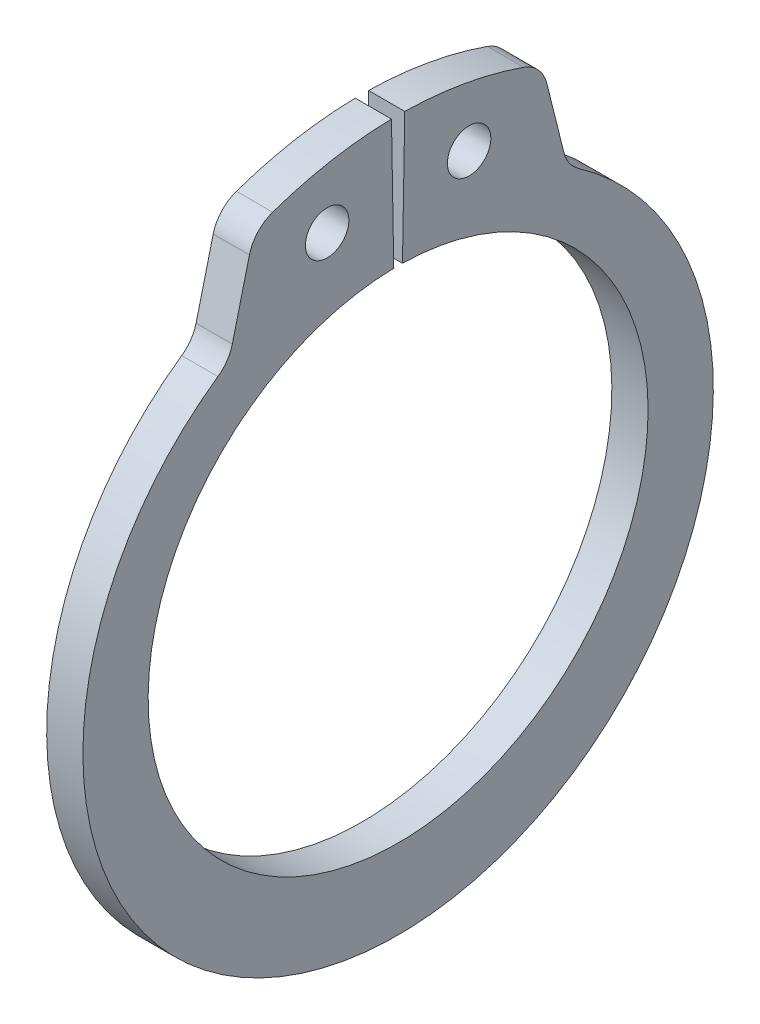
ISO-10303-21;
HEADER;
FILE_DESCRIPTION(('STEP AP214'),'2;1');
FILE_NAME('part.step','',(''),(''),'','','');
FILE_SCHEMA(('AUTOMOTIVE_DESIGN { 1 0 10303 214 1 1 1 1 }'));
ENDSEC;
DATA;
#1=APPLICATION_CONTEXT('core data for automotive mechanical design processes');
#2=APPLICATION_PROTOCOL_DEFINITION('international standard','automotive_design',2000,#1);
#3=PRODUCT_CONTEXT('',#1,'mechanical');
#4=PRODUCT('Part','Part','',(#3));
#5=PRODUCT_RELATED_PRODUCT_CATEGORY('part','',(#4));
#6=PRODUCT_DEFINITION_FORMATION('','',#4);
#7=PRODUCT_DEFINITION_CONTEXT('part definition',#1,'design');
#8=PRODUCT_DEFINITION('design','',#6,#7);
#9=PRODUCT_DEFINITION_SHAPE('','',#8);
#10=(LENGTH_UNIT() NAMED_UNIT(*) SI_UNIT(.MILLI.,.METRE.));
#11=(NAMED_UNIT(*) PLANE_ANGLE_UNIT() SI_UNIT($,.RADIAN.));
#12=(NAMED_UNIT(*) SI_UNIT($,.STERADIAN.) SOLID_ANGLE_UNIT());
#13=UNCERTAINTY_MEASURE_WITH_UNIT(LENGTH_MEASURE(1.E-05),#10,'distance_accuracy_value','');
#14=(GEOMETRIC_REPRESENTATION_CONTEXT(3) GLOBAL_UNCERTAINTY_ASSIGNED_CONTEXT((#13)) GLOBAL_UNIT_ASSIGNED_CONTEXT((#10,
#11,#12)) REPRESENTATION_CONTEXT('',''));
#15=CARTESIAN_POINT('',(0.,0.,0.));
#16=DIRECTION('',(0.,0.,1.));
#17=DIRECTION('',(1.,0.,0.));
#18=AXIS2_PLACEMENT_3D('',#15,#16,#17);
#19=CARTESIAN_POINT('',(-0.500000000000167,0.,0.));
#20=DIRECTION('',(0.999999999999999,0.,0.));
#21=DIRECTION('',(0.,0.,-1.));
#22=AXIS2_PLACEMENT_3D('',#19,#20,#21);
#23=PLANE('',#22);
#24=CARTESIAN_POINT('',(-0.500000000000167,8.66711980548374,-1.95962883161993));
#25=DIRECTION('',(-0.999999999999999,0.,0.));
#26=DIRECTION('',(0.,0.,1.));
#27=AXIS2_PLACEMENT_3D('',#24,#25,#26);
#28=CIRCLE('',#27,0.6);
#29=CARTESIAN_POINT('',(-0.500000000000167,8.66711980548374,-1.35962883161993));
#30=VERTEX_POINT('',#29);
#31=EDGE_CURVE('E125',#30,#30,#28,.F.);
#32=ORIENTED_EDGE('',*,*,#31,.T.);
#33=EDGE_LOOP('',(#32));
#34=FACE_BOUND('',#33,.T.);
#35=CARTESIAN_POINT('',(-0.500000000000167,8.96816184311078,3.13401869099739));
#36=DIRECTION('',(-0.999999999999999,0.,0.));
#37=DIRECTION('',(0.,0.,1.));
#38=AXIS2_PLACEMENT_3D('',#35,#36,#37);
#39=CIRCLE('',#38,1.);
#40=CARTESIAN_POINT('',(-0.500000000000167,9.9121788792349,3.46391539531066));
#41=VERTEX_POINT('',#40);
#42=CARTESIAN_POINT('',(-0.500000000000167,9.2100837387239,4.10431441727255));
#43=VERTEX_POINT('',#42);
#44=EDGE_CURVE('E111',#41,#43,#39,.F.);
#45=ORIENTED_EDGE('',*,*,#44,.F.);
#46=CARTESIAN_POINT('',(-0.500000000000167,0.,0.));
#47=DIRECTION('',(-0.999999999999999,0.,0.));
#48=DIRECTION('',(0.,0.,1.));
#49=AXIS2_PLACEMENT_3D('',#46,#47,#48);
#50=CIRCLE('',#49,10.5);
#51=CARTESIAN_POINT('',(-0.500000000000167,10.4984007991398,0.183250267589585));
#52=VERTEX_POINT('',#51);
#53=EDGE_CURVE('E104',#52,#41,#50,.F.);
#54=ORIENTED_EDGE('',*,*,#53,.F.);
#55=DIRECTION('',(0.,-0.999847695156392,-0.0174524064372835));
#56=VECTOR('',#55,1.);
#57=CARTESIAN_POINT('',(-0.500000000000167,6.8989490965663,0.120421604415721));
#58=LINE('',#57,#56);
#59=CARTESIAN_POINT('',(-0.500000000000167,6.8989490965663,0.120421604415721));
#60=VERTEX_POINT('',#59);
#61=EDGE_CURVE('E108',#52,#60,#58,.T.);
#62=ORIENTED_EDGE('',*,*,#61,.T.);
#63=CARTESIAN_POINT('',(-0.500000000000167,0.,0.));
#64=DIRECTION('',(-0.999999999999999,0.,0.));
#65=DIRECTION('',(0.,0.,1.));
#66=AXIS2_PLACEMENT_3D('',#63,#64,#65);
#67=CIRCLE('',#66,6.9);
#68=CARTESIAN_POINT('',(-0.500000000000167,6.89894909657696,-0.120421604417054));
#69=VERTEX_POINT('',#68);
#70=EDGE_CURVE('E171',#60,#69,#67,.F.);
#71=ORIENTED_EDGE('',*,*,#70,.T.);
#72=DIRECTION('',(0.,0.999847695156392,-0.0174524064372841));
#73=VECTOR('',#72,1.);
#74=CARTESIAN_POINT('',(-0.500000000000167,10.4984007991273,-0.183250267591362));
#75=LINE('',#74,#73);
#76=CARTESIAN_POINT('',(-0.500000000000167,10.4984007991273,-0.183250267591362));
#77=VERTEX_POINT('',#76);
#78=EDGE_CURVE('E133',#69,#77,#75,.T.);
#79=ORIENTED_EDGE('',*,*,#78,.T.);
#80=CARTESIAN_POINT('',(-0.500000000000167,0.,0.));
#81=DIRECTION('',(-0.999999999999999,0.,0.));
#82=DIRECTION('',(0.,0.,1.));
#83=AXIS2_PLACEMENT_3D('',#80,#81,#82);
#84=CIRCLE('',#83,10.5);
#85=CARTESIAN_POINT('',(-0.500000000000167,9.9121788792349,-3.46391539531199));
#86=VERTEX_POINT('',#85);
#87=EDGE_CURVE('E173',#86,#77,#84,.F.);
#88=ORIENTED_EDGE('',*,*,#87,.F.);
#89=CARTESIAN_POINT('',(-0.500000000000167,8.96816184311078,-3.1340186909965));
#90=DIRECTION('',(-0.999999999999999,0.,0.));
#91=DIRECTION('',(0.,0.,1.));
#92=AXIS2_PLACEMENT_3D('',#89,#90,#91);
#93=CIRCLE('',#92,1.);
#94=CARTESIAN_POINT('',(-0.500000000000167,9.21008373871679,-4.10431441727344));
#95=VERTEX_POINT('',#94);
#96=EDGE_CURVE('E176',#95,#86,#93,.F.);
#97=ORIENTED_EDGE('',*,*,#96,.F.);
#98=DIRECTION('',(0.,-0.970295726275998,-0.241921895599666));
#99=VECTOR('',#98,1.);
#100=CARTESIAN_POINT('',(-0.500000000000167,9.71734472744501,-3.97784004803237));
#101=LINE('',#100,#99);
#102=CARTESIAN_POINT('',(-0.500000000000167,7.3176153092458,-4.57615979124038));
#103=VERTEX_POINT('',#102);
#104=EDGE_CURVE('E138',#95,#103,#101,.T.);
#105=ORIENTED_EDGE('',*,*,#104,.T.);
#106=CARTESIAN_POINT('',(-0.500000000000167,7.55953720483937,-5.54645551751332));
#107=DIRECTION('',(-0.999999999999999,0.,0.));
#108=DIRECTION('',(0.,0.,1.));
#109=AXIS2_PLACEMENT_3D('',#106,#107,#108);
#110=CIRCLE('',#109,1.);
#111=CARTESIAN_POINT('',(-0.500000000000167,6.73911195962873,-4.97470170945258));
#112=VERTEX_POINT('',#111);
#113=EDGE_CURVE('E178',#103,#112,#110,.F.);
#114=ORIENTED_EDGE('',*,*,#113,.T.);
#115=CARTESIAN_POINT('',(-0.500000000000167,-0.399224177783708,-4.44089209850063E-13));
#116=DIRECTION('',(-0.999999999999999,0.,0.));
#117=DIRECTION('',(0.,0.,1.));
#118=AXIS2_PLACEMENT_3D('',#115,#116,#117);
#119=CIRCLE('',#118,8.70077582223046);
#120=CARTESIAN_POINT('',(-0.500000000000167,6.73911195963406,4.9747017094508));
#121=VERTEX_POINT('',#120);
#122=EDGE_CURVE('E181',#121,#112,#119,.F.);
#123=ORIENTED_EDGE('',*,*,#122,.F.);
#124=CARTESIAN_POINT('',(-0.500000000000167,7.55953720483227,5.54645551751332));
#125=DIRECTION('',(-0.999999999999999,0.,0.));
#126=DIRECTION('',(0.,0.,1.));
#127=AXIS2_PLACEMENT_3D('',#124,#125,#126);
#128=CIRCLE('',#127,1.);
#129=CARTESIAN_POINT('',(-0.500000000000167,7.3176153092458,4.57615979123815));
#130=VERTEX_POINT('',#129);
#131=EDGE_CURVE('E144',#121,#130,#128,.F.);
#132=ORIENTED_EDGE('',*,*,#131,.T.);
#133=DIRECTION('',(0.,0.970295726275998,-0.241921895599665));
#134=VECTOR('',#133,1.);
#135=CARTESIAN_POINT('',(-0.500000000000167,9.71734472744501,3.97784004803192));
#136=LINE('',#135,#134);
#137=EDGE_CURVE('E143',#130,#43,#136,.T.);
#138=ORIENTED_EDGE('',*,*,#137,.T.);
#139=EDGE_LOOP('',(#45,#54,#62,#71,#79,#88,#97,#105,#114,#123,#132,#138));
#140=FACE_BOUND('',#139,.T.);
#141=CARTESIAN_POINT('',(-0.500000000000167,8.66711980547663,1.95962883161993));
#142=DIRECTION('',(-0.999999999999999,0.,0.));
#143=DIRECTION('',(0.,0.,1.));
#144=AXIS2_PLACEMENT_3D('',#141,#142,#143);
#145=CIRCLE('',#144,0.6);
#146=CARTESIAN_POINT('',(-0.500000000000167,8.66711980547663,2.55962883161993));
#147=VERTEX_POINT('',#146);
#148=EDGE_CURVE('E19',#147,#147,#145,.F.);
#149=ORIENTED_EDGE('',*,*,#148,.T.);
#150=EDGE_LOOP('',(#149));
#151=FACE_BOUND('',#150,.T.);
#152=ADVANCED_FACE('F16',(#34,#140,#151),#23,.F.);
#153=CARTESIAN_POINT('',(0.500000000000167,8.66711980547663,1.95962883161993));
#154=DIRECTION('',(-0.999999999999999,0.,0.));
#155=DIRECTION('',(0.,0.,1.));
#156=AXIS2_PLACEMENT_3D('',#153,#154,#155);
#157=CYLINDRICAL_SURFACE('',#156,0.6);
#158=CARTESIAN_POINT('',(0.500000000000167,8.66711980547663,1.95962883161993));
#159=DIRECTION('',(-0.999999999999999,0.,0.));
#160=DIRECTION('',(0.,0.,1.));
#161=AXIS2_PLACEMENT_3D('',#158,#159,#160);
#162=CIRCLE('',#161,0.6);
#163=CARTESIAN_POINT('',(0.500000000000167,8.66711980547663,2.55962883161993));
#164=VERTEX_POINT('',#163);
#165=EDGE_CURVE('E128',#164,#164,#162,.T.);
#166=ORIENTED_EDGE('',*,*,#165,.F.);
#167=EDGE_LOOP('',(#166));
#168=FACE_BOUND('',#167,.T.);
#169=ORIENTED_EDGE('',*,*,#148,.F.);
#170=EDGE_LOOP('',(#169));
#171=FACE_BOUND('',#170,.T.);
#172=ADVANCED_FACE('F271',(#168,#171),#157,.F.);
#173=CARTESIAN_POINT('',(0.500000000000167,0.,0.));
#174=DIRECTION('',(-0.999999999999999,0.,0.));
#175=DIRECTION('',(0.,0.,1.));
#176=AXIS2_PLACEMENT_3D('',#173,#174,#175);
#177=CYLINDRICAL_SURFACE('',#176,10.5);
#178=CARTESIAN_POINT('',(0.500000000000167,0.,0.));
#179=DIRECTION('',(-0.999999999999999,0.,0.));
#180=DIRECTION('',(0.,0.,1.));
#181=AXIS2_PLACEMENT_3D('',#178,#179,#180);
#182=CIRCLE('',#181,10.5);
#183=CARTESIAN_POINT('',(0.500000000000167,10.4984007991398,0.183250267589585));
#184=VERTEX_POINT('',#183);
#185=CARTESIAN_POINT('',(0.500000000000167,9.9121788792349,3.46391539531066));
#186=VERTEX_POINT('',#185);
#187=EDGE_CURVE('E119',#184,#186,#182,.F.);
#188=ORIENTED_EDGE('',*,*,#187,.F.);
#189=DIRECTION('',(0.999999999999999,0.,0.));
#190=VECTOR('',#189,1.);
#191=CARTESIAN_POINT('',(0.500000000000167,10.4984007991398,0.183250267589585));
#192=LINE('',#191,#190);
#193=EDGE_CURVE('E116',#184,#52,#192,.F.);
#194=ORIENTED_EDGE('',*,*,#193,.T.);
#195=ORIENTED_EDGE('',*,*,#53,.T.);
#196=DIRECTION('',(-0.999999999999999,0.,0.));
#197=VECTOR('',#196,1.);
#198=CARTESIAN_POINT('',(0.500000000000167,9.9121788792349,3.46391539531066));
#199=LINE('',#198,#197);
#200=EDGE_CURVE('E114',#186,#41,#199,.T.);
#201=ORIENTED_EDGE('',*,*,#200,.F.);
#202=EDGE_LOOP('',(#188,#194,#195,#201));
#203=FACE_BOUND('',#202,.T.);
#204=ADVANCED_FACE('F117',(#203),#177,.T.);
#205=CARTESIAN_POINT('',(0.500000000000167,8.96816184311078,3.13401869099739));
#206=DIRECTION('',(-0.999999999999999,0.,0.));
#207=DIRECTION('',(0.,0.,1.));
#208=AXIS2_PLACEMENT_3D('',#205,#206,#207);
#209=CYLINDRICAL_SURFACE('',#208,1.);
#210=ORIENTED_EDGE('',*,*,#44,.T.);
#211=DIRECTION('',(0.999999999999999,0.,0.));
#212=VECTOR('',#211,1.);
#213=CARTESIAN_POINT('',(0.500000000000167,9.2100837387239,4.10431441727255));
#214=LINE('',#213,#212);
#215=CARTESIAN_POINT('',(0.500000000000167,9.2100837387239,4.10431441727255));
#216=VERTEX_POINT('',#215);
#217=EDGE_CURVE('E145',#43,#216,#214,.T.);
#218=ORIENTED_EDGE('',*,*,#217,.T.);
#219=CARTESIAN_POINT('',(0.500000000000167,8.96816184311078,3.13401869099739));
#220=DIRECTION('',(-0.999999999999999,0.,0.));
#221=DIRECTION('',(0.,0.,1.));
#222=AXIS2_PLACEMENT_3D('',#219,#220,#221);
#223=CIRCLE('',#222,1.);
#224=EDGE_CURVE('E165',#186,#216,#223,.F.);
#225=ORIENTED_EDGE('',*,*,#224,.F.);
#226=ORIENTED_EDGE('',*,*,#200,.T.);
#227=EDGE_LOOP('',(#210,#218,#225,#226));
#228=FACE_BOUND('',#227,.T.);
#229=ADVANCED_FACE('F189',(#228),#209,.T.);
#230=CARTESIAN_POINT('',(0.500000000000167,9.71734472744501,3.97784004803192));
#231=DIRECTION('',(0.,-0.241921895599665,-0.970295726275998));
#232=DIRECTION('',(0.,0.970295726275998,-0.241921895599665));
#233=AXIS2_PLACEMENT_3D('',#230,#231,#232);
#234=PLANE('',#233);
#235=DIRECTION('',(-0.999999999999999,0.,0.));
#236=VECTOR('',#235,1.);
#237=CARTESIAN_POINT('',(0.500000000000167,7.3176153092458,4.57615979123815));
#238=LINE('',#237,#236);
#239=CARTESIAN_POINT('',(0.500000000000167,7.3176153092458,4.57615979123815));
#240=VERTEX_POINT('',#239);
#241=EDGE_CURVE('E186',#130,#240,#238,.F.);
#242=ORIENTED_EDGE('',*,*,#241,.T.);
#243=DIRECTION('',(0.,-0.970295726275998,0.241921895599665));
#244=VECTOR('',#243,1.);
#245=CARTESIAN_POINT('',(0.500000000000167,9.2100837387239,4.10431441727255));
#246=LINE('',#245,#244);
#247=EDGE_CURVE('E164',#216,#240,#246,.T.);
#248=ORIENTED_EDGE('',*,*,#247,.F.);
#249=ORIENTED_EDGE('',*,*,#217,.F.);
#250=ORIENTED_EDGE('',*,*,#137,.F.);
#251=EDGE_LOOP('',(#242,#248,#249,#250));
#252=FACE_BOUND('',#251,.T.);
#253=ADVANCED_FACE('F217',(#252),#234,.F.);
#254=CARTESIAN_POINT('',(0.500000000000167,7.55953720483227,5.54645551751332));
#255=DIRECTION('',(-0.999999999999999,0.,0.));
#256=DIRECTION('',(0.,0.,1.));
#257=AXIS2_PLACEMENT_3D('',#254,#255,#256);
#258=CYLINDRICAL_SURFACE('',#257,1.);
#259=ORIENTED_EDGE('',*,*,#241,.F.);
#260=ORIENTED_EDGE('',*,*,#131,.F.);
#261=DIRECTION('',(-0.999999999999999,0.,0.));
#262=VECTOR('',#261,1.);
#263=CARTESIAN_POINT('',(0.500000000000167,6.73911195963406,4.9747017094508));
#264=LINE('',#263,#262);
#265=CARTESIAN_POINT('',(0.500000000000167,6.73911195963406,4.9747017094508));
#266=VERTEX_POINT('',#265);
#267=EDGE_CURVE('E184',#266,#121,#264,.T.);
#268=ORIENTED_EDGE('',*,*,#267,.F.);
#269=CARTESIAN_POINT('',(0.500000000000167,7.55953720483227,5.54645551751332));
#270=DIRECTION('',(-0.999999999999999,0.,0.));
#271=DIRECTION('',(0.,0.,1.));
#272=AXIS2_PLACEMENT_3D('',#269,#270,#271);
#273=CIRCLE('',#272,1.);
#274=EDGE_CURVE('E161',#240,#266,#273,.T.);
#275=ORIENTED_EDGE('',*,*,#274,.F.);
#276=EDGE_LOOP('',(#259,#260,#268,#275));
#277=FACE_BOUND('',#276,.T.);
#278=ADVANCED_FACE('F220',(#277),#258,.F.);
#279=CARTESIAN_POINT('',(0.500000000000167,-0.399224177783708,-4.44089209850063E-13));
#280=DIRECTION('',(-0.999999999999999,0.,0.));
#281=DIRECTION('',(0.,0.,1.));
#282=AXIS2_PLACEMENT_3D('',#279,#280,#281);
#283=CYLINDRICAL_SURFACE('',#282,8.70077582223046);
#284=ORIENTED_EDGE('',*,*,#122,.T.);
#285=DIRECTION('',(-0.999999999999999,0.,0.));
#286=VECTOR('',#285,1.);
#287=CARTESIAN_POINT('',(0.500000000000167,6.73911195962873,-4.97470170945258));
#288=LINE('',#287,#286);
#289=CARTESIAN_POINT('',(0.500000000000167,6.73911195962873,-4.97470170945258));
#290=VERTEX_POINT('',#289);
#291=EDGE_CURVE('E180',#112,#290,#288,.F.);
#292=ORIENTED_EDGE('',*,*,#291,.T.);
#293=CARTESIAN_POINT('',(0.500000000000167,-0.399224177783708,-4.44089209850063E-13));
#294=DIRECTION('',(-0.999999999999999,0.,0.));
#295=DIRECTION('',(0.,0.,1.));
#296=AXIS2_PLACEMENT_3D('',#293,#294,#295);
#297=CIRCLE('',#296,8.70077582223046);
#298=EDGE_CURVE('E159',#266,#290,#297,.F.);
#299=ORIENTED_EDGE('',*,*,#298,.F.);
#300=ORIENTED_EDGE('',*,*,#267,.T.);
#301=EDGE_LOOP('',(#284,#292,#299,#300));
#302=FACE_BOUND('',#301,.T.);
#303=ADVANCED_FACE('F225',(#302),#283,.T.);
#304=CARTESIAN_POINT('',(0.500000000000167,7.55953720483937,-5.54645551751332));
#305=DIRECTION('',(-0.999999999999999,0.,0.));
#306=DIRECTION('',(0.,0.,1.));
#307=AXIS2_PLACEMENT_3D('',#304,#305,#306);
#308=CYLINDRICAL_SURFACE('',#307,1.);
#309=ORIENTED_EDGE('',*,*,#291,.F.);
#310=ORIENTED_EDGE('',*,*,#113,.F.);
#311=DIRECTION('',(0.999999999999999,0.,0.));
#312=VECTOR('',#311,1.);
#313=CARTESIAN_POINT('',(0.500000000000167,7.3176153092458,-4.57615979124038));
#314=LINE('',#313,#312);
#315=CARTESIAN_POINT('',(0.500000000000167,7.3176153092458,-4.57615979124038));
#316=VERTEX_POINT('',#315);
#317=EDGE_CURVE('E142',#103,#316,#314,.T.);
#318=ORIENTED_EDGE('',*,*,#317,.T.);
#319=CARTESIAN_POINT('',(0.500000000000167,7.55953720483937,-5.54645551751332));
#320=DIRECTION('',(-0.999999999999999,0.,0.));
#321=DIRECTION('',(0.,0.,1.));
#322=AXIS2_PLACEMENT_3D('',#319,#320,#321);
#323=CIRCLE('',#322,1.);
#324=EDGE_CURVE('E156',#290,#316,#323,.T.);
#325=ORIENTED_EDGE('',*,*,#324,.F.);
#326=EDGE_LOOP('',(#309,#310,#318,#325));
#327=FACE_BOUND('',#326,.T.);
#328=ADVANCED_FACE('F227',(#327),#308,.F.);
#329=CARTESIAN_POINT('',(0.500000000000167,9.71734472744501,-3.97784004803237));
#330=DIRECTION('',(0.,-0.241921895599666,0.970295726275998));
#331=DIRECTION('',(0.,-0.970295726275998,-0.241921895599666));
#332=AXIS2_PLACEMENT_3D('',#329,#330,#331);
#333=PLANE('',#332);
#334=DIRECTION('',(-0.999999999999999,0.,0.));
#335=VECTOR('',#334,1.);
#336=CARTESIAN_POINT('',(0.500000000000167,9.21008373871679,-4.10431441727344));
#337=LINE('',#336,#335);
#338=CARTESIAN_POINT('',(0.500000000000167,9.21008373871679,-4.10431441727344));
#339=VERTEX_POINT('',#338);
#340=EDGE_CURVE('E141',#339,#95,#337,.T.);
#341=ORIENTED_EDGE('',*,*,#340,.F.);
#342=DIRECTION('',(0.,0.970295726275998,0.241921895599666));
#343=VECTOR('',#342,1.);
#344=CARTESIAN_POINT('',(0.500000000000167,7.3176153092458,-4.57615979124038));
#345=LINE('',#344,#343);
#346=EDGE_CURVE('E155',#316,#339,#345,.T.);
#347=ORIENTED_EDGE('',*,*,#346,.F.);
#348=ORIENTED_EDGE('',*,*,#317,.F.);
#349=ORIENTED_EDGE('',*,*,#104,.F.);
#350=EDGE_LOOP('',(#341,#347,#348,#349));
#351=FACE_BOUND('',#350,.T.);
#352=ADVANCED_FACE('F231',(#351),#333,.F.);
#353=CARTESIAN_POINT('',(0.500000000000167,8.96816184311078,-3.1340186909965));
#354=DIRECTION('',(-0.999999999999999,0.,0.));
#355=DIRECTION('',(0.,0.,1.));
#356=AXIS2_PLACEMENT_3D('',#353,#354,#355);
#357=CYLINDRICAL_SURFACE('',#356,1.);
#358=ORIENTED_EDGE('',*,*,#96,.T.);
#359=DIRECTION('',(-0.999999999999999,0.,0.));
#360=VECTOR('',#359,1.);
#361=CARTESIAN_POINT('',(0.500000000000167,9.9121788792349,-3.46391539531199));
#362=LINE('',#361,#360);
#363=CARTESIAN_POINT('',(0.500000000000167,9.9121788792349,-3.46391539531199));
#364=VERTEX_POINT('',#363);
#365=EDGE_CURVE('E175',#364,#86,#362,.T.);
#366=ORIENTED_EDGE('',*,*,#365,.F.);
#367=CARTESIAN_POINT('',(0.500000000000167,8.96816184311078,-3.1340186909965));
#368=DIRECTION('',(-0.999999999999999,0.,0.));
#369=DIRECTION('',(0.,0.,1.));
#370=AXIS2_PLACEMENT_3D('',#367,#368,#369);
#371=CIRCLE('',#370,1.);
#372=EDGE_CURVE('E152',#339,#364,#371,.F.);
#373=ORIENTED_EDGE('',*,*,#372,.F.);
#374=ORIENTED_EDGE('',*,*,#340,.T.);
#375=EDGE_LOOP('',(#358,#366,#373,#374));
#376=FACE_BOUND('',#375,.T.);
#377=ADVANCED_FACE('F235',(#376),#357,.T.);
#378=CARTESIAN_POINT('',(0.500000000000167,0.,0.));
#379=DIRECTION('',(-0.999999999999999,0.,0.));
#380=DIRECTION('',(0.,0.,1.));
#381=AXIS2_PLACEMENT_3D('',#378,#379,#380);
#382=CYLINDRICAL_SURFACE('',#381,10.5);
#383=ORIENTED_EDGE('',*,*,#87,.T.);
#384=DIRECTION('',(0.999999999999999,0.,0.));
#385=VECTOR('',#384,1.);
#386=CARTESIAN_POINT('',(0.500000000000167,10.4984007991273,-0.183250267591362));
#387=LINE('',#386,#385);
#388=CARTESIAN_POINT('',(0.500000000000167,10.4984007991273,-0.183250267591362));
#389=VERTEX_POINT('',#388);
#390=EDGE_CURVE('E137',#77,#389,#387,.T.);
#391=ORIENTED_EDGE('',*,*,#390,.T.);
#392=CARTESIAN_POINT('',(0.500000000000167,0.,0.));
#393=DIRECTION('',(-0.999999999999999,0.,0.));
#394=DIRECTION('',(0.,0.,1.));
#395=AXIS2_PLACEMENT_3D('',#392,#393,#394);
#396=CIRCLE('',#395,10.5);
#397=EDGE_CURVE('E149',#364,#389,#396,.F.);
#398=ORIENTED_EDGE('',*,*,#397,.F.);
#399=ORIENTED_EDGE('',*,*,#365,.T.);
#400=EDGE_LOOP('',(#383,#391,#398,#399));
#401=FACE_BOUND('',#400,.T.);
#402=ADVANCED_FACE('F239',(#401),#382,.T.);
#403=CARTESIAN_POINT('',(0.500000000000167,10.4984007991273,-0.183250267591362));
#404=DIRECTION('',(0.,-0.0174524064372841,-0.999847695156392));
#405=DIRECTION('',(0.,0.999847695156392,-0.0174524064372841));
#406=AXIS2_PLACEMENT_3D('',#403,#404,#405);
#407=PLANE('',#406);
#408=DIRECTION('',(-0.999999999999999,0.,0.));
#409=VECTOR('',#408,1.);
#410=CARTESIAN_POINT('',(0.500000000000167,6.89894909657696,-0.120421604417054));
#411=LINE('',#410,#409);
#412=CARTESIAN_POINT('',(0.500000000000167,6.89894909657696,-0.120421604417054));
#413=VERTEX_POINT('',#412);
#414=EDGE_CURVE('E136',#69,#413,#411,.F.);
#415=ORIENTED_EDGE('',*,*,#414,.T.);
#416=DIRECTION('',(0.,-0.999847695156392,0.017452406437284));
#417=VECTOR('',#416,1.);
#418=CARTESIAN_POINT('',(0.500000000000167,10.4984007991273,-0.183250267591362));
#419=LINE('',#418,#417);
#420=EDGE_CURVE('E148',#389,#413,#419,.T.);
#421=ORIENTED_EDGE('',*,*,#420,.F.);
#422=ORIENTED_EDGE('',*,*,#390,.F.);
#423=ORIENTED_EDGE('',*,*,#78,.F.);
#424=EDGE_LOOP('',(#415,#421,#422,#423));
#425=FACE_BOUND('',#424,.T.);
#426=ADVANCED_FACE('F244',(#425),#407,.F.);
#427=CARTESIAN_POINT('',(0.500000000000167,0.,0.));
#428=DIRECTION('',(-0.999999999999999,0.,0.));
#429=DIRECTION('',(0.,0.,1.));
#430=AXIS2_PLACEMENT_3D('',#427,#428,#429);
#431=CYLINDRICAL_SURFACE('',#430,6.9);
#432=DIRECTION('',(0.999999999999999,0.,0.));
#433=VECTOR('',#432,1.);
#434=CARTESIAN_POINT('',(0.500000000000167,6.8989490965663,0.120421604415721));
#435=LINE('',#434,#433);
#436=CARTESIAN_POINT('',(0.500000000000167,6.8989490965663,0.120421604415721));
#437=VERTEX_POINT('',#436);
#438=EDGE_CURVE('E122',#60,#437,#435,.T.);
#439=ORIENTED_EDGE('',*,*,#438,.T.);
#440=CARTESIAN_POINT('',(0.500000000000167,0.,0.));
#441=DIRECTION('',(-0.999999999999999,0.,0.));
#442=DIRECTION('',(0.,0.,1.));
#443=AXIS2_PLACEMENT_3D('',#440,#441,#442);
#444=CIRCLE('',#443,6.9);
#445=EDGE_CURVE('E34',#413,#437,#444,.T.);
#446=ORIENTED_EDGE('',*,*,#445,.F.);
#447=ORIENTED_EDGE('',*,*,#414,.F.);
#448=ORIENTED_EDGE('',*,*,#70,.F.);
#449=EDGE_LOOP('',(#439,#446,#447,#448));
#450=FACE_BOUND('',#449,.T.);
#451=ADVANCED_FACE('F247',(#450),#431,.F.);
#452=CARTESIAN_POINT('',(0.500000000000167,6.8989490965663,0.120421604415721));
#453=DIRECTION('',(0.,-0.0174524064372835,0.999847695156392));
#454=DIRECTION('',(0.,-0.999847695156392,-0.0174524064372835));
#455=AXIS2_PLACEMENT_3D('',#452,#453,#454);
#456=PLANE('',#455);
#457=ORIENTED_EDGE('',*,*,#193,.F.);
#458=DIRECTION('',(0.,0.999847695156392,0.0174524064372835));
#459=VECTOR('',#458,1.);
#460=CARTESIAN_POINT('',(0.500000000000167,6.8989490965663,0.120421604415721));
#461=LINE('',#460,#459);
#462=EDGE_CURVE('E25',#437,#184,#461,.T.);
#463=ORIENTED_EDGE('',*,*,#462,.F.);
#464=ORIENTED_EDGE('',*,*,#438,.F.);
#465=ORIENTED_EDGE('',*,*,#61,.F.);
#466=EDGE_LOOP('',(#457,#463,#464,#465));
#467=FACE_BOUND('',#466,.T.);
#468=ADVANCED_FACE('F124',(#467),#456,.F.);
#469=CARTESIAN_POINT('',(0.500000000000167,8.66711980548374,-1.95962883161993));
#470=DIRECTION('',(-0.999999999999999,0.,0.));
#471=DIRECTION('',(0.,0.,1.));
#472=AXIS2_PLACEMENT_3D('',#469,#470,#471);
#473=CYLINDRICAL_SURFACE('',#472,0.6);
#474=CARTESIAN_POINT('',(0.500000000000167,8.66711980548374,-1.95962883161993));
#475=DIRECTION('',(-0.999999999999999,0.,0.));
#476=DIRECTION('',(0.,0.,1.));
#477=AXIS2_PLACEMENT_3D('',#474,#475,#476);
#478=CIRCLE('',#477,0.6);
#479=CARTESIAN_POINT('',(0.500000000000167,8.66711980548374,-1.35962883161993));
#480=VERTEX_POINT('',#479);
#481=EDGE_CURVE('E11',#480,#480,#478,.T.);
#482=ORIENTED_EDGE('',*,*,#481,.F.);
#483=EDGE_LOOP('',(#482));
#484=FACE_BOUND('',#483,.T.);
#485=ORIENTED_EDGE('',*,*,#31,.F.);
#486=EDGE_LOOP('',(#485));
#487=FACE_BOUND('',#486,.T.);
#488=ADVANCED_FACE('F255',(#484,#487),#473,.F.);
#489=CARTESIAN_POINT('',(0.500000000000167,0.,0.));
#490=DIRECTION('',(0.999999999999999,0.,0.));
#491=DIRECTION('',(0.,0.,-1.));
#492=AXIS2_PLACEMENT_3D('',#489,#490,#491);
#493=PLANE('',#492);
#494=ORIENTED_EDGE('',*,*,#481,.T.);
#495=EDGE_LOOP('',(#494));
#496=FACE_BOUND('',#495,.T.);
#497=ORIENTED_EDGE('',*,*,#445,.T.);
#498=ORIENTED_EDGE('',*,*,#462,.T.);
#499=ORIENTED_EDGE('',*,*,#187,.T.);
#500=ORIENTED_EDGE('',*,*,#224,.T.);
#501=ORIENTED_EDGE('',*,*,#247,.T.);
#502=ORIENTED_EDGE('',*,*,#274,.T.);
#503=ORIENTED_EDGE('',*,*,#298,.T.);
#504=ORIENTED_EDGE('',*,*,#324,.T.);
#505=ORIENTED_EDGE('',*,*,#346,.T.);
#506=ORIENTED_EDGE('',*,*,#372,.T.);
#507=ORIENTED_EDGE('',*,*,#397,.T.);
#508=ORIENTED_EDGE('',*,*,#420,.T.);
#509=EDGE_LOOP('',(#497,#498,#499,#500,#501,#502,#503,#504,#505,#506,#507,#508));
#510=FACE_BOUND('',#509,.T.);
#511=ORIENTED_EDGE('',*,*,#165,.T.);
#512=EDGE_LOOP('',(#511));
#513=FACE_BOUND('',#512,.T.);
#514=ADVANCED_FACE('F193',(#496,#510,#513),#493,.T.);
#515=CLOSED_SHELL('',(#152,#172,#204,#229,#253,#278,#303,#328,#352,#377,#402,#426,#451,#468,
#488,#514));
#516=MANIFOLD_SOLID_BREP('B1',#515);
#517=ADVANCED_BREP_SHAPE_REPRESENTATION('',(#18,#516),#14);
#518=SHAPE_DEFINITION_REPRESENTATION(#9,#517);
ENDSEC;
END-ISO-10303-21;
